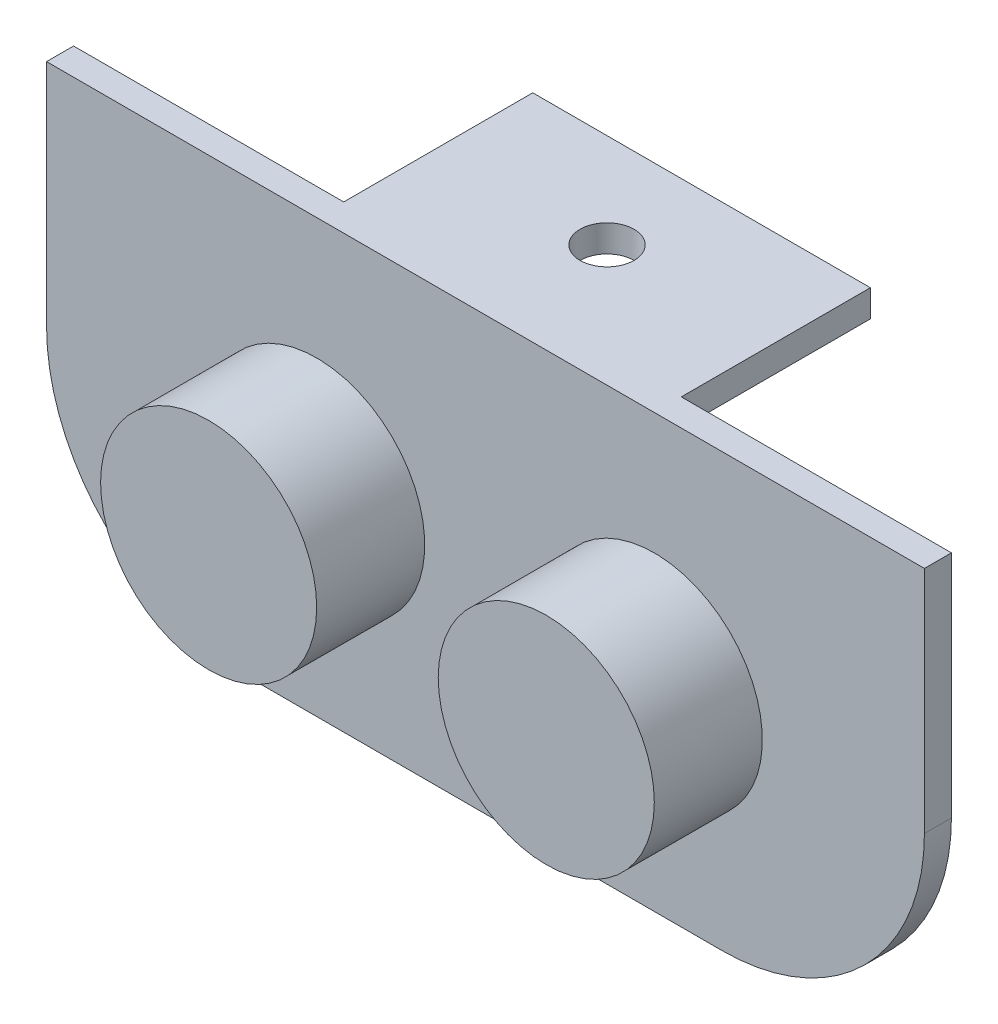
ISO-10303-21;
HEADER;
FILE_DESCRIPTION(('STEP AP214'),'2;1');
FILE_NAME('part.step','',(''),(''),'','','');
FILE_SCHEMA(('AUTOMOTIVE_DESIGN { 1 0 10303 214 1 1 1 1 }'));
ENDSEC;
DATA;
#1=APPLICATION_CONTEXT('core data for automotive mechanical design processes');
#2=APPLICATION_PROTOCOL_DEFINITION('international standard','automotive_design',2000,#1);
#3=PRODUCT_CONTEXT('',#1,'mechanical');
#4=PRODUCT('Part','Part','',(#3));
#5=PRODUCT_RELATED_PRODUCT_CATEGORY('part','',(#4));
#6=PRODUCT_DEFINITION_FORMATION('','',#4);
#7=PRODUCT_DEFINITION_CONTEXT('part definition',#1,'design');
#8=PRODUCT_DEFINITION('design','',#6,#7);
#9=PRODUCT_DEFINITION_SHAPE('','',#8);
#10=(LENGTH_UNIT() NAMED_UNIT(*) SI_UNIT(.MILLI.,.METRE.));
#11=(NAMED_UNIT(*) PLANE_ANGLE_UNIT() SI_UNIT($,.RADIAN.));
#12=(NAMED_UNIT(*) SI_UNIT($,.STERADIAN.) SOLID_ANGLE_UNIT());
#13=UNCERTAINTY_MEASURE_WITH_UNIT(LENGTH_MEASURE(1.E-05),#10,'distance_accuracy_value','');
#14=(GEOMETRIC_REPRESENTATION_CONTEXT(3) GLOBAL_UNCERTAINTY_ASSIGNED_CONTEXT((#13)) GLOBAL_UNIT_ASSIGNED_CONTEXT((#10,
#11,#12)) REPRESENTATION_CONTEXT('',''));
#15=CARTESIAN_POINT('',(0.,0.,0.));
#16=DIRECTION('',(0.,0.,1.));
#17=DIRECTION('',(1.,0.,0.));
#18=AXIS2_PLACEMENT_3D('',#15,#16,#17);
#19=CARTESIAN_POINT('',(32.5,-16.,2.));
#20=DIRECTION('',(-1.,0.,0.));
#21=DIRECTION('',(0.,0.,1.));
#22=AXIS2_PLACEMENT_3D('',#19,#20,#21);
#23=PLANE('',#22);
#24=DIRECTION('',(0.,1.,0.));
#25=VECTOR('',#24,1.);
#26=CARTESIAN_POINT('',(32.5,-16.,2.));
#27=LINE('',#26,#25);
#28=CARTESIAN_POINT('',(32.5,-1.,2.));
#29=VERTEX_POINT('',#28);
#30=CARTESIAN_POINT('',(32.5,16.,2.));
#31=VERTEX_POINT('',#30);
#32=EDGE_CURVE('E163',#29,#31,#27,.T.);
#33=ORIENTED_EDGE('',*,*,#32,.F.);
#34=DIRECTION('',(0.,0.,-1.));
#35=VECTOR('',#34,1.);
#36=CARTESIAN_POINT('',(32.5,-1.,2.));
#37=LINE('',#36,#35);
#38=CARTESIAN_POINT('',(32.5,-1.,0.));
#39=VERTEX_POINT('',#38);
#40=EDGE_CURVE('E192',#29,#39,#37,.T.);
#41=ORIENTED_EDGE('',*,*,#40,.T.);
#42=DIRECTION('',(0.,1.,0.));
#43=VECTOR('',#42,1.);
#44=CARTESIAN_POINT('',(32.5,-16.,0.));
#45=LINE('',#44,#43);
#46=CARTESIAN_POINT('',(32.5,16.,0.));
#47=VERTEX_POINT('',#46);
#48=EDGE_CURVE('E153',#39,#47,#45,.T.);
#49=ORIENTED_EDGE('',*,*,#48,.T.);
#50=DIRECTION('',(0.,0.,-1.));
#51=VECTOR('',#50,1.);
#52=CARTESIAN_POINT('',(32.5,16.,2.));
#53=LINE('',#52,#51);
#54=EDGE_CURVE('E188',#31,#47,#53,.T.);
#55=ORIENTED_EDGE('',*,*,#54,.F.);
#56=EDGE_LOOP('',(#33,#41,#49,#55));
#57=FACE_BOUND('',#56,.T.);
#58=ADVANCED_FACE('F43',(#57),#23,.F.);
#59=CARTESIAN_POINT('',(-32.5,16.,2.));
#60=DIRECTION('',(0.,-1.,0.));
#61=DIRECTION('',(0.,0.,-1.));
#62=AXIS2_PLACEMENT_3D('',#59,#60,#61);
#63=PLANE('',#62);
#64=CARTESIAN_POINT('',(0.,16.,-7.));
#65=DIRECTION('',(0.,1.,0.));
#66=DIRECTION('',(0.,0.,1.));
#67=AXIS2_PLACEMENT_3D('',#64,#65,#66);
#68=CIRCLE('',#67,2.);
#69=CARTESIAN_POINT('',(0.,16.,-5.));
#70=VERTEX_POINT('',#69);
#71=EDGE_CURVE('E219',#70,#70,#68,.T.);
#72=ORIENTED_EDGE('',*,*,#71,.F.);
#73=EDGE_LOOP('',(#72));
#74=FACE_BOUND('',#73,.T.);
#75=DIRECTION('',(-1.,0.,0.));
#76=VECTOR('',#75,1.);
#77=CARTESIAN_POINT('',(-32.5,16.,0.));
#78=LINE('',#77,#76);
#79=CARTESIAN_POINT('',(12.5,16.,0.));
#80=VERTEX_POINT('',#79);
#81=EDGE_CURVE('E177',#47,#80,#78,.T.);
#82=ORIENTED_EDGE('',*,*,#81,.T.);
#83=DIRECTION('',(0.,0.,1.));
#84=VECTOR('',#83,1.);
#85=CARTESIAN_POINT('',(12.5,16.,-14.));
#86=LINE('',#85,#84);
#87=CARTESIAN_POINT('',(12.5,16.,-14.));
#88=VERTEX_POINT('',#87);
#89=EDGE_CURVE('E133',#88,#80,#86,.T.);
#90=ORIENTED_EDGE('',*,*,#89,.F.);
#91=DIRECTION('',(1.,0.,0.));
#92=VECTOR('',#91,1.);
#93=CARTESIAN_POINT('',(12.5,16.,-14.));
#94=LINE('',#93,#92);
#95=CARTESIAN_POINT('',(-12.5,16.,-14.));
#96=VERTEX_POINT('',#95);
#97=EDGE_CURVE('E125',#96,#88,#94,.T.);
#98=ORIENTED_EDGE('',*,*,#97,.F.);
#99=DIRECTION('',(0.,0.,1.));
#100=VECTOR('',#99,1.);
#101=CARTESIAN_POINT('',(-12.5,16.,-14.));
#102=LINE('',#101,#100);
#103=CARTESIAN_POINT('',(-12.5,16.,0.));
#104=VERTEX_POINT('',#103);
#105=EDGE_CURVE('E130',#96,#104,#102,.T.);
#106=ORIENTED_EDGE('',*,*,#105,.T.);
#107=CARTESIAN_POINT('',(-32.5,16.,0.));
#108=VERTEX_POINT('',#107);
#109=EDGE_CURVE('E157',#104,#108,#78,.T.);
#110=ORIENTED_EDGE('',*,*,#109,.T.);
#111=DIRECTION('',(0.,0.,-1.));
#112=VECTOR('',#111,1.);
#113=CARTESIAN_POINT('',(-32.5,16.,2.));
#114=LINE('',#113,#112);
#115=CARTESIAN_POINT('',(-32.5,16.,2.));
#116=VERTEX_POINT('',#115);
#117=EDGE_CURVE('E175',#116,#108,#114,.T.);
#118=ORIENTED_EDGE('',*,*,#117,.F.);
#119=DIRECTION('',(-1.,0.,0.));
#120=VECTOR('',#119,1.);
#121=CARTESIAN_POINT('',(-32.5,16.,2.));
#122=LINE('',#121,#120);
#123=EDGE_CURVE('E166',#31,#116,#122,.T.);
#124=ORIENTED_EDGE('',*,*,#123,.F.);
#125=ORIENTED_EDGE('',*,*,#54,.T.);
#126=EDGE_LOOP('',(#82,#90,#98,#106,#110,#118,#124,#125));
#127=FACE_BOUND('',#126,.T.);
#128=ADVANCED_FACE('F128',(#74,#127),#63,.F.);
#129=CARTESIAN_POINT('',(-32.5,-16.,2.));
#130=DIRECTION('',(1.,0.,0.));
#131=DIRECTION('',(0.,0.,-1.));
#132=AXIS2_PLACEMENT_3D('',#129,#130,#131);
#133=PLANE('',#132);
#134=DIRECTION('',(0.,-1.,0.));
#135=VECTOR('',#134,1.);
#136=CARTESIAN_POINT('',(-32.5,-16.,0.));
#137=LINE('',#136,#135);
#138=CARTESIAN_POINT('',(-32.5,-1.,0.));
#139=VERTEX_POINT('',#138);
#140=EDGE_CURVE('E180',#108,#139,#137,.T.);
#141=ORIENTED_EDGE('',*,*,#140,.T.);
#142=DIRECTION('',(0.,0.,-1.));
#143=VECTOR('',#142,1.);
#144=CARTESIAN_POINT('',(-32.5,-1.,2.));
#145=LINE('',#144,#143);
#146=CARTESIAN_POINT('',(-32.5,-1.,2.));
#147=VERTEX_POINT('',#146);
#148=EDGE_CURVE('E59',#139,#147,#145,.F.);
#149=ORIENTED_EDGE('',*,*,#148,.T.);
#150=DIRECTION('',(0.,-1.,0.));
#151=VECTOR('',#150,1.);
#152=CARTESIAN_POINT('',(-32.5,-16.,2.));
#153=LINE('',#152,#151);
#154=EDGE_CURVE('E170',#116,#147,#153,.T.);
#155=ORIENTED_EDGE('',*,*,#154,.F.);
#156=ORIENTED_EDGE('',*,*,#117,.T.);
#157=EDGE_LOOP('',(#141,#149,#155,#156));
#158=FACE_BOUND('',#157,.T.);
#159=ADVANCED_FACE('F252',(#158),#133,.F.);
#160=CARTESIAN_POINT('',(-32.5,-16.,2.));
#161=DIRECTION('',(0.,1.,0.));
#162=DIRECTION('',(0.,0.,1.));
#163=AXIS2_PLACEMENT_3D('',#160,#161,#162);
#164=PLANE('',#163);
#165=DIRECTION('',(1.,0.,0.));
#166=VECTOR('',#165,1.);
#167=CARTESIAN_POINT('',(-32.5,-16.,0.));
#168=LINE('',#167,#166);
#169=CARTESIAN_POINT('',(-17.5,-16.,0.));
#170=VERTEX_POINT('',#169);
#171=CARTESIAN_POINT('',(17.5,-16.,0.));
#172=VERTEX_POINT('',#171);
#173=EDGE_CURVE('E167',#170,#172,#168,.T.);
#174=ORIENTED_EDGE('',*,*,#173,.T.);
#175=DIRECTION('',(0.,0.,-1.));
#176=VECTOR('',#175,1.);
#177=CARTESIAN_POINT('',(17.5,-16.,2.));
#178=LINE('',#177,#176);
#179=CARTESIAN_POINT('',(17.5,-16.,2.));
#180=VERTEX_POINT('',#179);
#181=EDGE_CURVE('E67',#172,#180,#178,.F.);
#182=ORIENTED_EDGE('',*,*,#181,.T.);
#183=DIRECTION('',(1.,0.,0.));
#184=VECTOR('',#183,1.);
#185=CARTESIAN_POINT('',(-32.5,-16.,2.));
#186=LINE('',#185,#184);
#187=CARTESIAN_POINT('',(-17.5,-16.,2.));
#188=VERTEX_POINT('',#187);
#189=EDGE_CURVE('E173',#188,#180,#186,.T.);
#190=ORIENTED_EDGE('',*,*,#189,.F.);
#191=DIRECTION('',(0.,0.,-1.));
#192=VECTOR('',#191,1.);
#193=CARTESIAN_POINT('',(-17.5,-16.,2.));
#194=LINE('',#193,#192);
#195=EDGE_CURVE('E202',#188,#170,#194,.T.);
#196=ORIENTED_EDGE('',*,*,#195,.T.);
#197=EDGE_LOOP('',(#174,#182,#190,#196));
#198=FACE_BOUND('',#197,.T.);
#199=ADVANCED_FACE('F230',(#198),#164,.F.);
#200=CARTESIAN_POINT('',(0.,0.,2.));
#201=DIRECTION('',(0.,0.,-1.));
#202=DIRECTION('',(-1.,0.,0.));
#203=AXIS2_PLACEMENT_3D('',#200,#201,#202);
#204=PLANE('',#203);
#205=CARTESIAN_POINT('',(12.5,-1.,2.));
#206=DIRECTION('',(0.,0.,-1.));
#207=DIRECTION('',(-1.,0.,0.));
#208=AXIS2_PLACEMENT_3D('',#205,#206,#207);
#209=CIRCLE('',#208,8.);
#210=CARTESIAN_POINT('',(4.5,-1.,2.));
#211=VERTEX_POINT('',#210);
#212=EDGE_CURVE('E11',#211,#211,#209,.F.);
#213=ORIENTED_EDGE('',*,*,#212,.F.);
#214=EDGE_LOOP('',(#213));
#215=FACE_BOUND('',#214,.T.);
#216=CARTESIAN_POINT('',(-12.5,-1.,2.));
#217=DIRECTION('',(0.,0.,-1.));
#218=DIRECTION('',(-1.,0.,0.));
#219=AXIS2_PLACEMENT_3D('',#216,#217,#218);
#220=CIRCLE('',#219,8.);
#221=CARTESIAN_POINT('',(-20.5,-1.,2.));
#222=VERTEX_POINT('',#221);
#223=EDGE_CURVE('E52',#222,#222,#220,.F.);
#224=ORIENTED_EDGE('',*,*,#223,.F.);
#225=EDGE_LOOP('',(#224));
#226=FACE_BOUND('',#225,.T.);
#227=ORIENTED_EDGE('',*,*,#189,.T.);
#228=CARTESIAN_POINT('',(17.5,-1.,2.));
#229=DIRECTION('',(0.,0.,-1.));
#230=DIRECTION('',(-1.,0.,0.));
#231=AXIS2_PLACEMENT_3D('',#228,#229,#230);
#232=CIRCLE('',#231,15.);
#233=EDGE_CURVE('E211',#180,#29,#232,.F.);
#234=ORIENTED_EDGE('',*,*,#233,.T.);
#235=ORIENTED_EDGE('',*,*,#32,.T.);
#236=ORIENTED_EDGE('',*,*,#123,.T.);
#237=ORIENTED_EDGE('',*,*,#154,.T.);
#238=CARTESIAN_POINT('',(-17.5,-1.,2.));
#239=DIRECTION('',(0.,0.,-1.));
#240=DIRECTION('',(-1.,0.,0.));
#241=AXIS2_PLACEMENT_3D('',#238,#239,#240);
#242=CIRCLE('',#241,15.);
#243=EDGE_CURVE('E208',#147,#188,#242,.F.);
#244=ORIENTED_EDGE('',*,*,#243,.T.);
#245=EDGE_LOOP('',(#227,#234,#235,#236,#237,#244));
#246=FACE_BOUND('',#245,.T.);
#247=ADVANCED_FACE('F226',(#215,#226,#246),#204,.F.);
#248=CARTESIAN_POINT('',(0.,0.,0.));
#249=DIRECTION('',(0.,0.,-1.));
#250=DIRECTION('',(-1.,0.,0.));
#251=AXIS2_PLACEMENT_3D('',#248,#249,#250);
#252=PLANE('',#251);
#253=ORIENTED_EDGE('',*,*,#48,.F.);
#254=CARTESIAN_POINT('',(17.5,-1.,0.));
#255=DIRECTION('',(0.,0.,-1.));
#256=DIRECTION('',(-1.,0.,0.));
#257=AXIS2_PLACEMENT_3D('',#254,#255,#256);
#258=CIRCLE('',#257,15.);
#259=EDGE_CURVE('E199',#39,#172,#258,.T.);
#260=ORIENTED_EDGE('',*,*,#259,.T.);
#261=ORIENTED_EDGE('',*,*,#173,.F.);
#262=CARTESIAN_POINT('',(-17.5,-1.,0.));
#263=DIRECTION('',(0.,0.,-1.));
#264=DIRECTION('',(-1.,0.,0.));
#265=AXIS2_PLACEMENT_3D('',#262,#263,#264);
#266=CIRCLE('',#265,15.);
#267=EDGE_CURVE('E196',#170,#139,#266,.T.);
#268=ORIENTED_EDGE('',*,*,#267,.T.);
#269=ORIENTED_EDGE('',*,*,#140,.F.);
#270=ORIENTED_EDGE('',*,*,#109,.F.);
#271=DIRECTION('',(0.,1.,0.));
#272=VECTOR('',#271,1.);
#273=CARTESIAN_POINT('',(-12.5,14.,0.));
#274=LINE('',#273,#272);
#275=CARTESIAN_POINT('',(-12.5,14.,0.));
#276=VERTEX_POINT('',#275);
#277=EDGE_CURVE('E151',#276,#104,#274,.T.);
#278=ORIENTED_EDGE('',*,*,#277,.F.);
#279=DIRECTION('',(-1.,0.,0.));
#280=VECTOR('',#279,1.);
#281=CARTESIAN_POINT('',(12.5,14.,0.));
#282=LINE('',#281,#280);
#283=CARTESIAN_POINT('',(12.5,14.,0.));
#284=VERTEX_POINT('',#283);
#285=EDGE_CURVE('E148',#284,#276,#282,.T.);
#286=ORIENTED_EDGE('',*,*,#285,.F.);
#287=DIRECTION('',(0.,-1.,0.));
#288=VECTOR('',#287,1.);
#289=CARTESIAN_POINT('',(12.5,14.,0.));
#290=LINE('',#289,#288);
#291=EDGE_CURVE('E247',#80,#284,#290,.T.);
#292=ORIENTED_EDGE('',*,*,#291,.F.);
#293=ORIENTED_EDGE('',*,*,#81,.F.);
#294=EDGE_LOOP('',(#253,#260,#261,#268,#269,#270,#278,#286,#292,#293));
#295=FACE_BOUND('',#294,.T.);
#296=ADVANCED_FACE('F229',(#295),#252,.T.);
#297=CARTESIAN_POINT('',(-12.5,14.,-14.));
#298=DIRECTION('',(1.,0.,0.));
#299=DIRECTION('',(0.,0.,-1.));
#300=AXIS2_PLACEMENT_3D('',#297,#298,#299);
#301=PLANE('',#300);
#302=ORIENTED_EDGE('',*,*,#277,.T.);
#303=ORIENTED_EDGE('',*,*,#105,.F.);
#304=DIRECTION('',(0.,1.,0.));
#305=VECTOR('',#304,1.);
#306=CARTESIAN_POINT('',(-12.5,14.,-14.));
#307=LINE('',#306,#305);
#308=CARTESIAN_POINT('',(-12.5,14.,-14.));
#309=VERTEX_POINT('',#308);
#310=EDGE_CURVE('E138',#309,#96,#307,.T.);
#311=ORIENTED_EDGE('',*,*,#310,.F.);
#312=DIRECTION('',(0.,0.,1.));
#313=VECTOR('',#312,1.);
#314=CARTESIAN_POINT('',(-12.5,14.,-14.));
#315=LINE('',#314,#313);
#316=EDGE_CURVE('E452',#309,#276,#315,.T.);
#317=ORIENTED_EDGE('',*,*,#316,.T.);
#318=EDGE_LOOP('',(#302,#303,#311,#317));
#319=FACE_BOUND('',#318,.T.);
#320=ADVANCED_FACE('F150',(#319),#301,.F.);
#321=CARTESIAN_POINT('',(12.5,14.,-14.));
#322=DIRECTION('',(-1.,0.,0.));
#323=DIRECTION('',(0.,0.,1.));
#324=AXIS2_PLACEMENT_3D('',#321,#322,#323);
#325=PLANE('',#324);
#326=ORIENTED_EDGE('',*,*,#291,.T.);
#327=DIRECTION('',(0.,0.,1.));
#328=VECTOR('',#327,1.);
#329=CARTESIAN_POINT('',(12.5,14.,-14.));
#330=LINE('',#329,#328);
#331=CARTESIAN_POINT('',(12.5,14.,-14.));
#332=VERTEX_POINT('',#331);
#333=EDGE_CURVE('E159',#332,#284,#330,.T.);
#334=ORIENTED_EDGE('',*,*,#333,.F.);
#335=DIRECTION('',(0.,-1.,0.));
#336=VECTOR('',#335,1.);
#337=CARTESIAN_POINT('',(12.5,14.,-14.));
#338=LINE('',#337,#336);
#339=EDGE_CURVE('E137',#88,#332,#338,.T.);
#340=ORIENTED_EDGE('',*,*,#339,.F.);
#341=ORIENTED_EDGE('',*,*,#89,.T.);
#342=EDGE_LOOP('',(#326,#334,#340,#341));
#343=FACE_BOUND('',#342,.T.);
#344=ADVANCED_FACE('F277',(#343),#325,.F.);
#345=CARTESIAN_POINT('',(12.5,14.,-14.));
#346=DIRECTION('',(0.,1.,0.));
#347=DIRECTION('',(0.,0.,1.));
#348=AXIS2_PLACEMENT_3D('',#345,#346,#347);
#349=PLANE('',#348);
#350=CARTESIAN_POINT('',(0.,14.,-7.));
#351=DIRECTION('',(0.,1.,0.));
#352=DIRECTION('',(0.,0.,1.));
#353=AXIS2_PLACEMENT_3D('',#350,#351,#352);
#354=CIRCLE('',#353,2.);
#355=CARTESIAN_POINT('',(0.,14.,-5.));
#356=VERTEX_POINT('',#355);
#357=EDGE_CURVE('E216',#356,#356,#354,.T.);
#358=ORIENTED_EDGE('',*,*,#357,.T.);
#359=EDGE_LOOP('',(#358));
#360=FACE_BOUND('',#359,.T.);
#361=ORIENTED_EDGE('',*,*,#285,.T.);
#362=ORIENTED_EDGE('',*,*,#316,.F.);
#363=DIRECTION('',(-1.,0.,0.));
#364=VECTOR('',#363,1.);
#365=CARTESIAN_POINT('',(12.5,14.,-14.));
#366=LINE('',#365,#364);
#367=EDGE_CURVE('E143',#332,#309,#366,.T.);
#368=ORIENTED_EDGE('',*,*,#367,.F.);
#369=ORIENTED_EDGE('',*,*,#333,.T.);
#370=EDGE_LOOP('',(#361,#362,#368,#369));
#371=FACE_BOUND('',#370,.T.);
#372=ADVANCED_FACE('F272',(#360,#371),#349,.F.);
#373=CARTESIAN_POINT('',(0.,0.,-14.));
#374=DIRECTION('',(0.,0.,1.));
#375=DIRECTION('',(1.,0.,0.));
#376=AXIS2_PLACEMENT_3D('',#373,#374,#375);
#377=PLANE('',#376);
#378=ORIENTED_EDGE('',*,*,#310,.T.);
#379=ORIENTED_EDGE('',*,*,#97,.T.);
#380=ORIENTED_EDGE('',*,*,#339,.T.);
#381=ORIENTED_EDGE('',*,*,#367,.T.);
#382=EDGE_LOOP('',(#378,#379,#380,#381));
#383=FACE_BOUND('',#382,.T.);
#384=ADVANCED_FACE('F141',(#383),#377,.F.);
#385=CARTESIAN_POINT('',(17.5,-1.,2.));
#386=DIRECTION('',(0.,0.,-1.));
#387=DIRECTION('',(-1.,0.,0.));
#388=AXIS2_PLACEMENT_3D('',#385,#386,#387);
#389=CYLINDRICAL_SURFACE('',#388,15.);
#390=ORIENTED_EDGE('',*,*,#233,.F.);
#391=ORIENTED_EDGE('',*,*,#181,.F.);
#392=ORIENTED_EDGE('',*,*,#259,.F.);
#393=ORIENTED_EDGE('',*,*,#40,.F.);
#394=EDGE_LOOP('',(#390,#391,#392,#393));
#395=FACE_BOUND('',#394,.T.);
#396=ADVANCED_FACE('F239',(#395),#389,.T.);
#397=CARTESIAN_POINT('',(-17.5,-1.,2.));
#398=DIRECTION('',(0.,0.,-1.));
#399=DIRECTION('',(-1.,0.,0.));
#400=AXIS2_PLACEMENT_3D('',#397,#398,#399);
#401=CYLINDRICAL_SURFACE('',#400,15.);
#402=ORIENTED_EDGE('',*,*,#243,.F.);
#403=ORIENTED_EDGE('',*,*,#148,.F.);
#404=ORIENTED_EDGE('',*,*,#267,.F.);
#405=ORIENTED_EDGE('',*,*,#195,.F.);
#406=EDGE_LOOP('',(#402,#403,#404,#405));
#407=FACE_BOUND('',#406,.T.);
#408=ADVANCED_FACE('F45',(#407),#401,.T.);
#409=CARTESIAN_POINT('',(0.,-16.,-7.));
#410=DIRECTION('',(0.,1.,0.));
#411=DIRECTION('',(0.,0.,1.));
#412=AXIS2_PLACEMENT_3D('',#409,#410,#411);
#413=CYLINDRICAL_SURFACE('',#412,2.);
#414=ORIENTED_EDGE('',*,*,#71,.T.);
#415=EDGE_LOOP('',(#414));
#416=FACE_BOUND('',#415,.T.);
#417=ORIENTED_EDGE('',*,*,#357,.F.);
#418=EDGE_LOOP('',(#417));
#419=FACE_BOUND('',#418,.T.);
#420=ADVANCED_FACE('F271',(#416,#419),#413,.F.);
#421=CARTESIAN_POINT('',(-12.5,-1.,10.));
#422=DIRECTION('',(0.,0.,-1.));
#423=DIRECTION('',(-1.,0.,0.));
#424=AXIS2_PLACEMENT_3D('',#421,#422,#423);
#425=CYLINDRICAL_SURFACE('',#424,8.);
#426=CARTESIAN_POINT('',(-12.5,-1.,10.));
#427=DIRECTION('',(0.,0.,1.));
#428=DIRECTION('',(1.,0.,0.));
#429=AXIS2_PLACEMENT_3D('',#426,#427,#428);
#430=CIRCLE('',#429,8.);
#431=CARTESIAN_POINT('',(-4.5,-1.,10.));
#432=VERTEX_POINT('',#431);
#433=EDGE_CURVE('E439',#432,#432,#430,.T.);
#434=ORIENTED_EDGE('',*,*,#433,.F.);
#435=EDGE_LOOP('',(#434));
#436=FACE_BOUND('',#435,.T.);
#437=ORIENTED_EDGE('',*,*,#223,.T.);
#438=EDGE_LOOP('',(#437));
#439=FACE_BOUND('',#438,.T.);
#440=ADVANCED_FACE('F224',(#436,#439),#425,.T.);
#441=CARTESIAN_POINT('',(-12.5,-1.,10.));
#442=DIRECTION('',(0.,0.,1.));
#443=DIRECTION('',(1.,0.,0.));
#444=AXIS2_PLACEMENT_3D('',#441,#442,#443);
#445=PLANE('',#444);
#446=ORIENTED_EDGE('',*,*,#433,.T.);
#447=EDGE_LOOP('',(#446));
#448=FACE_BOUND('',#447,.T.);
#449=ADVANCED_FACE('F337',(#448),#445,.T.);
#450=CARTESIAN_POINT('',(12.5,-1.,10.));
#451=DIRECTION('',(0.,0.,-1.));
#452=DIRECTION('',(-1.,0.,0.));
#453=AXIS2_PLACEMENT_3D('',#450,#451,#452);
#454=CYLINDRICAL_SURFACE('',#453,8.);
#455=CARTESIAN_POINT('',(12.5,-1.,10.));
#456=DIRECTION('',(0.,0.,1.));
#457=DIRECTION('',(1.,0.,0.));
#458=AXIS2_PLACEMENT_3D('',#455,#456,#457);
#459=CIRCLE('',#458,8.);
#460=CARTESIAN_POINT('',(20.5,-1.,10.));
#461=VERTEX_POINT('',#460);
#462=EDGE_CURVE('E437',#461,#461,#459,.T.);
#463=ORIENTED_EDGE('',*,*,#462,.F.);
#464=EDGE_LOOP('',(#463));
#465=FACE_BOUND('',#464,.T.);
#466=ORIENTED_EDGE('',*,*,#212,.T.);
#467=EDGE_LOOP('',(#466));
#468=FACE_BOUND('',#467,.T.);
#469=ADVANCED_FACE('F347',(#465,#468),#454,.T.);
#470=CARTESIAN_POINT('',(12.5,-1.,10.));
#471=DIRECTION('',(0.,0.,1.));
#472=DIRECTION('',(1.,0.,0.));
#473=AXIS2_PLACEMENT_3D('',#470,#471,#472);
#474=PLANE('',#473);
#475=ORIENTED_EDGE('',*,*,#462,.T.);
#476=EDGE_LOOP('',(#475));
#477=FACE_BOUND('',#476,.T.);
#478=ADVANCED_FACE('F358',(#477),#474,.T.);
#479=CLOSED_SHELL('',(#58,#128,#159,#199,#247,#296,#320,#344,#372,#384,#396,#408,#420,#440,#449,
#469,#478));
#480=MANIFOLD_SOLID_BREP('B2',#479);
#481=ADVANCED_BREP_SHAPE_REPRESENTATION('',(#18,#480),#14);
#482=SHAPE_DEFINITION_REPRESENTATION(#9,#481);
ENDSEC;
END-ISO-10303-21;
